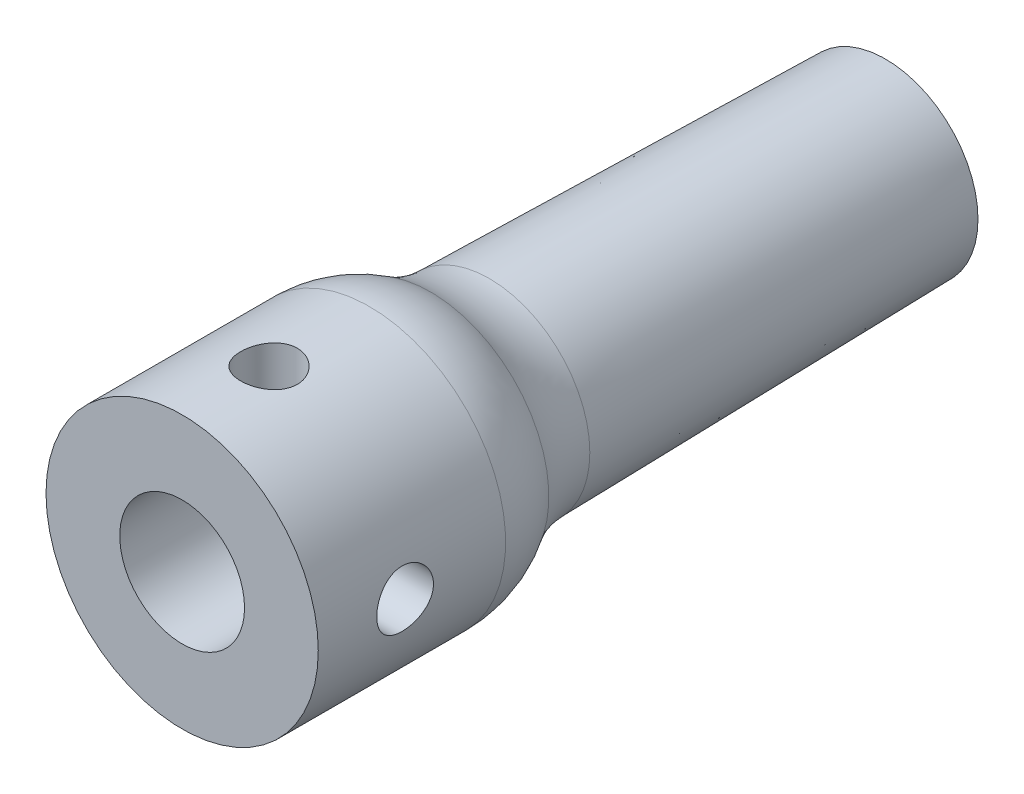
ISO-10303-21;
HEADER;
FILE_DESCRIPTION(('STEP AP214'),'2;1');
FILE_NAME('part.step','',(''),(''),'','','');
FILE_SCHEMA(('AUTOMOTIVE_DESIGN { 1 0 10303 214 1 1 1 1 }'));
ENDSEC;
DATA;
#1=APPLICATION_CONTEXT('core data for automotive mechanical design processes');
#2=APPLICATION_PROTOCOL_DEFINITION('international standard','automotive_design',2000,#1);
#3=PRODUCT_CONTEXT('',#1,'mechanical');
#4=PRODUCT('Part','Part','',(#3));
#5=PRODUCT_RELATED_PRODUCT_CATEGORY('part','',(#4));
#6=PRODUCT_DEFINITION_FORMATION('','',#4);
#7=PRODUCT_DEFINITION_CONTEXT('part definition',#1,'design');
#8=PRODUCT_DEFINITION('design','',#6,#7);
#9=PRODUCT_DEFINITION_SHAPE('','',#8);
#10=(LENGTH_UNIT() NAMED_UNIT(*) SI_UNIT(.MILLI.,.METRE.));
#11=(NAMED_UNIT(*) PLANE_ANGLE_UNIT() SI_UNIT($,.RADIAN.));
#12=(NAMED_UNIT(*) SI_UNIT($,.STERADIAN.) SOLID_ANGLE_UNIT());
#13=UNCERTAINTY_MEASURE_WITH_UNIT(LENGTH_MEASURE(1.E-05),#10,'distance_accuracy_value','');
#14=(GEOMETRIC_REPRESENTATION_CONTEXT(3) GLOBAL_UNCERTAINTY_ASSIGNED_CONTEXT((#13)) GLOBAL_UNIT_ASSIGNED_CONTEXT((#10,
#11,#12)) REPRESENTATION_CONTEXT('',''));
#15=CARTESIAN_POINT('',(0.,0.,0.));
#16=DIRECTION('',(0.,0.,1.));
#17=DIRECTION('',(1.,0.,0.));
#18=AXIS2_PLACEMENT_3D('',#15,#16,#17);
#19=CARTESIAN_POINT('',(0.,0.,0.));
#20=DIRECTION('',(0.,0.,1.));
#21=DIRECTION('',(1.,0.,0.));
#22=AXIS2_PLACEMENT_3D('',#19,#20,#21);
#23=PLANE('',#22);
#24=CARTESIAN_POINT('',(0.,0.,0.));
#25=DIRECTION('',(0.,0.,1.));
#26=DIRECTION('',(1.,0.,0.));
#27=AXIS2_PLACEMENT_3D('',#24,#25,#26);
#28=CIRCLE('',#27,4.07477969432257);
#29=CARTESIAN_POINT('',(4.07477969432257,0.,0.));
#30=VERTEX_POINT('',#29);
#31=EDGE_CURVE('E47',#30,#30,#28,.T.);
#32=ORIENTED_EDGE('',*,*,#31,.F.);
#33=EDGE_LOOP('',(#32));
#34=FACE_BOUND('',#33,.T.);
#35=CARTESIAN_POINT('',(0.,0.,0.));
#36=DIRECTION('',(0.,0.,1.));
#37=DIRECTION('',(1.,0.,0.));
#38=AXIS2_PLACEMENT_3D('',#35,#36,#37);
#39=CIRCLE('',#38,2.75);
#40=CARTESIAN_POINT('',(2.75,0.,0.));
#41=VERTEX_POINT('',#40);
#42=EDGE_CURVE('E52',#41,#41,#39,.T.);
#43=ORIENTED_EDGE('',*,*,#42,.T.);
#44=EDGE_LOOP('',(#43));
#45=FACE_BOUND('',#44,.T.);
#46=ADVANCED_FACE('F32',(#34,#45),#23,.F.);
#47=CARTESIAN_POINT('',(0.,0.,21.));
#48=DIRECTION('',(0.,0.,1.));
#49=DIRECTION('',(1.,0.,0.));
#50=AXIS2_PLACEMENT_3D('',#47,#48,#49);
#51=CONICAL_SURFACE('',#50,4.5,0.0202458193231343);
#52=CARTESIAN_POINT('',(0.,0.,17.4606792831943));
#53=DIRECTION('',(0.,0.,-1.));
#54=DIRECTION('',(-1.,0.,0.));
#55=AXIS2_PLACEMENT_3D('',#52,#53,#54);
#56=CIRCLE('',#55,4.42833376013854);
#57=CARTESIAN_POINT('',(-4.42833376013854,0.,17.4606792831943));
#58=VERTEX_POINT('',#57);
#59=EDGE_CURVE('E43',#58,#58,#56,.T.);
#60=ORIENTED_EDGE('',*,*,#59,.T.);
#61=EDGE_LOOP('',(#60));
#62=FACE_BOUND('',#61,.T.);
#63=ORIENTED_EDGE('',*,*,#31,.T.);
#64=EDGE_LOOP('',(#63));
#65=FACE_BOUND('',#64,.T.);
#66=ADVANCED_FACE('F112',(#62,#65),#51,.T.);
#67=CARTESIAN_POINT('',(0.,0.,21.));
#68=DIRECTION('',(0.,0.,-1.));
#69=DIRECTION('',(-1.,0.,0.));
#70=AXIS2_PLACEMENT_3D('',#67,#68,#69);
#71=CYLINDRICAL_SURFACE('',#70,2.75);
#72=CARTESIAN_POINT('',(-1.25000000000001,2.44948974278318,27.1729614874227));
#73=CARTESIAN_POINT('',(-1.24999649350402,2.44949368228765,27.2389699161995));
#74=CARTESIAN_POINT('',(-1.2447378244484,2.45219701957714,27.3050813094361));
#75=CARTESIAN_POINT('',(-1.22393957837269,2.46264090706274,27.4353438383866));
#76=CARTESIAN_POINT('',(-1.20837468013773,2.47039386281898,27.4994897379659));
#77=CARTESIAN_POINT('',(-1.16772642001969,2.48986254372279,27.6237000216856));
#78=CARTESIAN_POINT('',(-1.14268689094074,2.50155999360655,27.6837817216932));
#79=CARTESIAN_POINT('',(-1.08393224916964,2.52757186133796,27.7988765803601));
#80=CARTESIAN_POINT('',(-1.05021805532981,2.54188600196967,27.8538902750035));
#81=CARTESIAN_POINT('',(-0.972392408700577,2.57270625364897,27.9614086240548));
#82=CARTESIAN_POINT('',(-0.927732432282878,2.58929511801968,28.0134927196714));
#83=CARTESIAN_POINT('',(-0.83043006696107,2.62212163999063,28.1097497616301));
#84=CARTESIAN_POINT('',(-0.777784257759762,2.63835914368329,28.1539193004361));
#85=CARTESIAN_POINT('',(-0.662562027156228,2.66969243866209,28.2353870538531));
#86=CARTESIAN_POINT('',(-0.59960560002215,2.68468107121253,28.272192834668));
#87=CARTESIAN_POINT('',(-0.467587746509015,2.71078910043921,28.3345039831394));
#88=CARTESIAN_POINT('',(-0.398529543785711,2.72191052506912,28.3600152755192));
#89=CARTESIAN_POINT('',(-0.260702263713035,2.73844039615752,28.3974286544761));
#90=CARTESIAN_POINT('',(-0.192168860207244,2.74415398467794,28.4100612360869));
#91=CARTESIAN_POINT('',(-0.0537337492110804,2.75034616684861,28.4237387277347));
#92=CARTESIAN_POINT('',(0.0161672725634519,2.75082731987365,28.4247893029563));
#93=CARTESIAN_POINT('',(0.149965080853614,2.74666518415707,28.4156124739761));
#94=CARTESIAN_POINT('',(0.213931079826308,2.74238926124843,28.4061936197753));
#95=CARTESIAN_POINT('',(0.339258309266332,2.72972015837754,28.3777575542483));
#96=CARTESIAN_POINT('',(0.400619346222459,2.72132667311912,28.3587396311972));
#97=CARTESIAN_POINT('',(0.520129625913238,2.70105493201454,28.311451471528));
#98=CARTESIAN_POINT('',(0.578216222535315,2.68912586975713,28.2830455922203));
#99=CARTESIAN_POINT('',(0.688949986561342,2.66291017293157,28.2179388205696));
#100=CARTESIAN_POINT('',(0.74159515134029,2.64862267537057,28.1812348900002));
#101=CARTESIAN_POINT('',(0.844521462681004,2.61770923899541,28.0971117317786));
#102=CARTESIAN_POINT('',(0.894259880394276,2.60098761803526,28.0490628402856));
#103=CARTESIAN_POINT('',(0.985234665281752,2.56790977516793,27.9453443644101));
#104=CARTESIAN_POINT('',(1.02646641790381,2.55155375585301,27.8896706709549));
#105=CARTESIAN_POINT('',(1.10104506894183,2.52029978809173,27.7691515377821));
#106=CARTESIAN_POINT('',(1.13395121798233,2.50550118974753,27.7040052374333));
#107=CARTESIAN_POINT('',(1.1880966741559,2.48028797326795,27.5682511572691));
#108=CARTESIAN_POINT('',(1.20934612514664,2.46986954528397,27.4976481871876));
#109=CARTESIAN_POINT('',(1.23805393738081,2.45559834607939,27.3584332769877));
#110=CARTESIAN_POINT('',(1.24640186410718,2.45132366398273,27.2900491765278));
#111=CARTESIAN_POINT('',(1.25172089001371,2.44861334601463,27.1527381902121));
#112=CARTESIAN_POINT('',(1.24869736351006,2.45017495182541,27.0838115761232));
#113=CARTESIAN_POINT('',(1.2321742269346,2.45851920297554,26.9533932204686));
#114=CARTESIAN_POINT('',(1.21955926621106,2.4648605869208,26.8917571596424));
#115=CARTESIAN_POINT('',(1.18544405201489,2.48144703005369,26.7715538899964));
#116=CARTESIAN_POINT('',(1.16394143575354,2.49169312725522,26.7129875019199));
#117=CARTESIAN_POINT('',(1.11159822979466,2.51549375704147,26.5975962512233));
#118=CARTESIAN_POINT('',(1.08037807246865,2.52917735570446,26.5409711150016));
#119=CARTESIAN_POINT('',(1.00984087724323,2.55815836558199,26.4334618868724));
#120=CARTESIAN_POINT('',(0.970519936824034,2.57345655287929,26.3825805803879));
#121=CARTESIAN_POINT('',(0.880267857698424,2.60579094908277,26.2826801814853));
#122=CARTESIAN_POINT('',(0.828567938261515,2.62284763397897,26.2343592537482));
#123=CARTESIAN_POINT('',(0.717441468187266,2.6553959105149,26.1469123741477));
#124=CARTESIAN_POINT('',(0.658013600012903,2.67088723447429,26.1077879934032));
#125=CARTESIAN_POINT('',(0.532064634336902,2.69881612600613,26.0395640040982));
#126=CARTESIAN_POINT('',(0.465471699055584,2.71121763780736,26.0105812937458));
#127=CARTESIAN_POINT('',(0.327635980482038,2.73129834562413,25.964481031089));
#128=CARTESIAN_POINT('',(0.256396588146275,2.73898094374761,25.9473549296094));
#129=CARTESIAN_POINT('',(0.117466176582578,2.74830068808535,25.9266738973591));
#130=CARTESIAN_POINT('',(0.0499494636179257,2.75037367442807,25.9221397931885));
#131=CARTESIAN_POINT('',(-0.0848898576600219,2.74951533998594,25.9240273595185));
#132=CARTESIAN_POINT('',(-0.152212508787349,2.74658522376394,25.9304463929067));
#133=CARTESIAN_POINT('',(-0.281391999197506,2.73629690997646,25.9533642646965));
#134=CARTESIAN_POINT('',(-0.343356169931427,2.72915761294651,25.969365387763));
#135=CARTESIAN_POINT('',(-0.463664188063046,2.71131278427636,26.0103965311602));
#136=CARTESIAN_POINT('',(-0.522007419358078,2.70060664770133,26.0354280831084));
#137=CARTESIAN_POINT('',(-0.636378008545826,2.6760233581899,26.0950600288525));
#138=CARTESIAN_POINT('',(-0.692177439915833,2.66202358016364,26.130045670727));
#139=CARTESIAN_POINT('',(-0.797359045105219,2.63243399966462,26.2080722679654));
#140=CARTESIAN_POINT('',(-0.846738398309358,2.61684350365391,26.2511167437919));
#141=CARTESIAN_POINT('',(-0.941951228398719,2.5841761482303,26.3482042521535));
#142=CARTESIAN_POINT('',(-0.987154004244797,2.56708296999994,26.4028623846656));
#143=CARTESIAN_POINT('',(-1.06790018403239,2.53455914709152,26.51942008708));
#144=CARTESIAN_POINT('',(-1.10343722102546,2.51912960228939,26.5813243919205));
#145=CARTESIAN_POINT('',(-1.16392442382468,2.49176565985743,26.7114739449307));
#146=CARTESIAN_POINT('',(-1.18878813351712,2.47986003874525,26.7797657124466));
#147=CARTESIAN_POINT('',(-1.22631765086684,2.46152275925821,26.9201973216138));
#148=CARTESIAN_POINT('',(-1.23902440311468,2.45507273502283,26.9923233766772));
#149=CARTESIAN_POINT('',(-1.24688636059437,2.45107611117236,27.08295258552));
#150=CARTESIAN_POINT('',(-1.24805272823734,2.45048261290847,27.1009269311961));
#151=CARTESIAN_POINT('',(-1.24961004053751,2.44968888381115,27.1369187867105));
#152=CARTESIAN_POINT('',(-1.25000095753309,2.44948866700671,27.1549362980656));
#153=CARTESIAN_POINT('',(-1.25000000000001,2.44948974278318,27.1729614874227));
#154=B_SPLINE_CURVE_WITH_KNOTS('',3,(#72,#73,#74,#75,#76,#77,#78,#79,#80,#81,#82,#83,#84,#85,
#86,#87,#88,#89,#90,#91,#92,#93,#94,#95,#96,#97,#98,#99,#100,#101,#102,#103,#104,#105,#106,#107,
#108,#109,#110,#111,#112,#113,#114,#115,#116,#117,#118,#119,#120,#121,#122,#123,#124,#125,#126,
#127,#128,#129,#130,#131,#132,#133,#134,#135,#136,#137,#138,#139,#140,#141,#142,#143,#144,#145,
#146,#147,#148,#149,#150,#151,#152,#153),.UNSPECIFIED.,.T.,.F.,(4,2,2,2,2,2,2,2,2,2,2,2,2,2,2,2,
2,2,2,2,2,2,2,2,2,2,2,2,2,2,2,2,2,2,2,2,2,2,2,2,4),(0.,0.197949490145129,0.396387132894558,
0.593917744022097,0.791427440589959,1.00227982105295,1.21322276498815,1.43542192427071,
1.65750438655095,1.86613997239169,2.07467350237463,2.26815547775457,2.46165180100119,
2.65807591784026,2.85457206969011,3.06708946120133,3.27972183419203,3.50196731162577,
3.72401907920019,3.92994297853523,4.13576956743683,4.32461933407749,4.51351933887032,
4.71099397075556,4.90856395864764,5.12594226056978,5.34335767200034,5.5632024114476,
5.78288846688929,5.98493699995733,6.18693689403808,6.37925788088371,6.57161150192545,
6.77276176443707,6.97400010437292,7.19187634216838,7.40989575221213,7.62964928571055,
7.8486600571131,7.90271299908979,7.95676786918959),.UNSPECIFIED.);
#155=CARTESIAN_POINT('',(-1.25000000000001,2.44948974278318,27.1729614874227));
#156=VERTEX_POINT('',#155);
#157=EDGE_CURVE('E69',#156,#156,#154,.T.);
#158=ORIENTED_EDGE('',*,*,#157,.T.);
#159=EDGE_LOOP('',(#158));
#160=FACE_BOUND('',#159,.T.);
#161=CARTESIAN_POINT('',(2.44948974278318,1.25,27.1729614874227));
#162=CARTESIAN_POINT('',(2.44949368228765,1.24999649350401,27.2389699161995));
#163=CARTESIAN_POINT('',(2.45219701957715,1.24473782444839,27.3050813094361));
#164=CARTESIAN_POINT('',(2.46264090706275,1.22393957837268,27.4353438383866));
#165=CARTESIAN_POINT('',(2.47039386281899,1.20837468013772,27.4994897379659));
#166=CARTESIAN_POINT('',(2.4898625437228,1.16772642001968,27.6237000216856));
#167=CARTESIAN_POINT('',(2.50155999360655,1.14268689094073,27.6837817216932));
#168=CARTESIAN_POINT('',(2.52757186133796,1.08393224916963,27.7988765803601));
#169=CARTESIAN_POINT('',(2.54188600196967,1.0502180553298,27.8538902750035));
#170=CARTESIAN_POINT('',(2.57270625364897,0.972392408700568,27.9614086240548));
#171=CARTESIAN_POINT('',(2.58929511801969,0.92773243228287,28.0134927196714));
#172=CARTESIAN_POINT('',(2.62212163999064,0.830430066961062,28.1097497616301));
#173=CARTESIAN_POINT('',(2.6383591436833,0.777784257759754,28.1539193004361));
#174=CARTESIAN_POINT('',(2.6696924386621,0.662562027156218,28.2353870538531));
#175=CARTESIAN_POINT('',(2.68468107121254,0.599605600022141,28.272192834668));
#176=CARTESIAN_POINT('',(2.71078910043921,0.467587746509006,28.3345039831394));
#177=CARTESIAN_POINT('',(2.72191052506912,0.398529543785702,28.3600152755192));
#178=CARTESIAN_POINT('',(2.73844039615752,0.260702263713026,28.3974286544761));
#179=CARTESIAN_POINT('',(2.74415398467794,0.192168860207235,28.4100612360869));
#180=CARTESIAN_POINT('',(2.75034616684861,0.0537337492110712,28.4237387277347));
#181=CARTESIAN_POINT('',(2.75082731987365,-0.016167272563461,28.4247893029563));
#182=CARTESIAN_POINT('',(2.74666518415707,-0.149965080853623,28.4156124739761));
#183=CARTESIAN_POINT('',(2.74238926124843,-0.213931079826317,28.4061936197753));
#184=CARTESIAN_POINT('',(2.72972015837753,-0.339258309266341,28.3777575542483));
#185=CARTESIAN_POINT('',(2.72132667311912,-0.400619346222469,28.3587396311972));
#186=CARTESIAN_POINT('',(2.70105493201454,-0.520129625913247,28.311451471528));
#187=CARTESIAN_POINT('',(2.68912586975713,-0.578216222535324,28.2830455922203));
#188=CARTESIAN_POINT('',(2.66291017293157,-0.688949986561352,28.2179388205696));
#189=CARTESIAN_POINT('',(2.64862267537057,-0.741595151340299,28.1812348900002));
#190=CARTESIAN_POINT('',(2.61770923899541,-0.844521462681013,28.0971117317786));
#191=CARTESIAN_POINT('',(2.60098761803526,-0.894259880394285,28.0490628402856));
#192=CARTESIAN_POINT('',(2.56790977516793,-0.985234665281761,27.9453443644101));
#193=CARTESIAN_POINT('',(2.551553755853,-1.02646641790382,27.8896706709549));
#194=CARTESIAN_POINT('',(2.52029978809173,-1.10104506894183,27.7691515377821));
#195=CARTESIAN_POINT('',(2.50550118974752,-1.13395121798234,27.7040052374333));
#196=CARTESIAN_POINT('',(2.48028797326795,-1.18809667415591,27.5682511572691));
#197=CARTESIAN_POINT('',(2.46986954528397,-1.20934612514665,27.4976481871876));
#198=CARTESIAN_POINT('',(2.45559834607939,-1.23805393738082,27.3584332769877));
#199=CARTESIAN_POINT('',(2.45132366398273,-1.24640186410719,27.2900491765278));
#200=CARTESIAN_POINT('',(2.44861334601462,-1.25172089001372,27.1527381902121));
#201=CARTESIAN_POINT('',(2.45017495182541,-1.24869736351006,27.0838115761232));
#202=CARTESIAN_POINT('',(2.45851920297554,-1.23217422693461,26.9533932204686));
#203=CARTESIAN_POINT('',(2.46486058692079,-1.21955926621107,26.8917571596424));
#204=CARTESIAN_POINT('',(2.48144703005369,-1.18544405201489,26.7715538899964));
#205=CARTESIAN_POINT('',(2.49169312725522,-1.16394143575355,26.7129875019199));
#206=CARTESIAN_POINT('',(2.51549375704146,-1.11159822979467,26.5975962512233));
#207=CARTESIAN_POINT('',(2.52917735570445,-1.08037807246866,26.5409711150016));
#208=CARTESIAN_POINT('',(2.55815836558199,-1.00984087724324,26.4334618868724));
#209=CARTESIAN_POINT('',(2.57345655287928,-0.970519936824045,26.3825805803879));
#210=CARTESIAN_POINT('',(2.60579094908277,-0.880267857698436,26.2826801814853));
#211=CARTESIAN_POINT('',(2.62284763397897,-0.828567938261526,26.2343592537482));
#212=CARTESIAN_POINT('',(2.65539591051489,-0.717441468187277,26.1469123741477));
#213=CARTESIAN_POINT('',(2.67088723447429,-0.658013600012915,26.1077879934032));
#214=CARTESIAN_POINT('',(2.69881612600612,-0.532064634336915,26.0395640040982));
#215=CARTESIAN_POINT('',(2.71121763780736,-0.465471699055596,26.0105812937458));
#216=CARTESIAN_POINT('',(2.73129834562413,-0.32763598048205,25.964481031089));
#217=CARTESIAN_POINT('',(2.73898094374761,-0.256396588146287,25.9473549296094));
#218=CARTESIAN_POINT('',(2.74830068808534,-0.117466176582589,25.9266738973591));
#219=CARTESIAN_POINT('',(2.75037367442807,-0.0499494636179371,25.9221397931885));
#220=CARTESIAN_POINT('',(2.74951533998594,0.0848898576600104,25.9240273595185));
#221=CARTESIAN_POINT('',(2.74658522376394,0.152212508787337,25.9304463929067));
#222=CARTESIAN_POINT('',(2.73629690997646,0.281391999197495,25.9533642646965));
#223=CARTESIAN_POINT('',(2.72915761294651,0.343356169931416,25.969365387763));
#224=CARTESIAN_POINT('',(2.71131278427636,0.463664188063035,26.0103965311602));
#225=CARTESIAN_POINT('',(2.70060664770133,0.522007419358068,26.0354280831084));
#226=CARTESIAN_POINT('',(2.6760233581899,0.636378008545817,26.0950600288525));
#227=CARTESIAN_POINT('',(2.66202358016364,0.692177439915824,26.130045670727));
#228=CARTESIAN_POINT('',(2.63243399966462,0.797359045105211,26.2080722679654));
#229=CARTESIAN_POINT('',(2.61684350365391,0.846738398309348,26.2511167437919));
#230=CARTESIAN_POINT('',(2.5841761482303,0.94195122839871,26.3482042521535));
#231=CARTESIAN_POINT('',(2.56708296999995,0.987154004244788,26.4028623846656));
#232=CARTESIAN_POINT('',(2.53455914709152,1.06790018403238,26.51942008708));
#233=CARTESIAN_POINT('',(2.51912960228939,1.10343722102546,26.5813243919205));
#234=CARTESIAN_POINT('',(2.49176565985743,1.16392442382467,26.7114739449307));
#235=CARTESIAN_POINT('',(2.47986003874526,1.18878813351711,26.7797657124466));
#236=CARTESIAN_POINT('',(2.46152275925821,1.22631765086683,26.9201973216138));
#237=CARTESIAN_POINT('',(2.45507273502283,1.23902440311468,26.9923233766772));
#238=CARTESIAN_POINT('',(2.45107611117236,1.24688636059436,27.08295258552));
#239=CARTESIAN_POINT('',(2.45048261290848,1.24805272823733,27.1009269311961));
#240=CARTESIAN_POINT('',(2.44968888381116,1.2496100405375,27.1369187867105));
#241=CARTESIAN_POINT('',(2.44948866700672,1.25000095753308,27.1549362980656));
#242=CARTESIAN_POINT('',(2.44948974278318,1.25,27.1729614874227));
#243=B_SPLINE_CURVE_WITH_KNOTS('',3,(#161,#162,#163,#164,#165,#166,#167,#168,#169,#170,#171,
#172,#173,#174,#175,#176,#177,#178,#179,#180,#181,#182,#183,#184,#185,#186,#187,#188,#189,#190,
#191,#192,#193,#194,#195,#196,#197,#198,#199,#200,#201,#202,#203,#204,#205,#206,#207,#208,#209,
#210,#211,#212,#213,#214,#215,#216,#217,#218,#219,#220,#221,#222,#223,#224,#225,#226,#227,#228,
#229,#230,#231,#232,#233,#234,#235,#236,#237,#238,#239,#240,#241,#242),.UNSPECIFIED.,.T.,.F.,(4,
2,2,2,2,2,2,2,2,2,2,2,2,2,2,2,2,2,2,2,2,2,2,2,2,2,2,2,2,2,2,2,2,2,2,2,2,2,2,2,4),(0.,
0.197949490145129,0.396387132894558,0.593917744022089,0.791427440589959,1.00227982105295,
1.21322276498815,1.43542192427071,1.65750438655095,1.86613997239169,2.07467350237463,
2.26815547775457,2.46165180100119,2.65807591784026,2.85457206969012,3.06708946120133,
3.27972183419203,3.50196731162577,3.72401907920019,3.92994297853523,4.13576956743683,
4.32461933407749,4.51351933887032,4.71099397075556,4.90856395864764,5.12594226056978,
5.34335767200034,5.5632024114476,5.78288846688929,5.98493699995733,6.18693689403808,
6.37925788088371,6.57161150192545,6.77276176443707,6.97400010437292,7.19187634216838,
7.40989575221213,7.62964928571055,7.8486600571131,7.90271299908979,7.9567678691896),.UNSPECIFIED.);
#244=CARTESIAN_POINT('',(2.44948974278318,1.25,27.1729614874227));
#245=VERTEX_POINT('',#244);
#246=EDGE_CURVE('E61',#245,#245,#243,.T.);
#247=ORIENTED_EDGE('',*,*,#246,.T.);
#248=EDGE_LOOP('',(#247));
#249=FACE_BOUND('',#248,.T.);
#250=ORIENTED_EDGE('',*,*,#42,.F.);
#251=EDGE_LOOP('',(#250));
#252=FACE_BOUND('',#251,.T.);
#253=CARTESIAN_POINT('',(0.,0.,31.));
#254=DIRECTION('',(0.,0.,1.));
#255=DIRECTION('',(1.,0.,0.));
#256=AXIS2_PLACEMENT_3D('',#253,#254,#255);
#257=CIRCLE('',#256,2.75);
#258=CARTESIAN_POINT('',(2.75,0.,31.));
#259=VERTEX_POINT('',#258);
#260=EDGE_CURVE('E58',#259,#259,#257,.T.);
#261=ORIENTED_EDGE('',*,*,#260,.T.);
#262=EDGE_LOOP('',(#261));
#263=FACE_BOUND('',#262,.T.);
#264=ADVANCED_FACE('F107',(#160,#249,#252,#263),#71,.F.);
#265=CARTESIAN_POINT('',(0.,0.,31.));
#266=DIRECTION('',(0.,0.,1.));
#267=DIRECTION('',(1.,0.,0.));
#268=AXIS2_PLACEMENT_3D('',#265,#266,#267);
#269=PLANE('',#268);
#270=CARTESIAN_POINT('',(0.,0.,31.));
#271=DIRECTION('',(0.,0.,1.));
#272=DIRECTION('',(1.,0.,0.));
#273=AXIS2_PLACEMENT_3D('',#270,#271,#272);
#274=CIRCLE('',#273,6.);
#275=CARTESIAN_POINT('',(6.,0.,31.));
#276=VERTEX_POINT('',#275);
#277=EDGE_CURVE('E55',#276,#276,#274,.T.);
#278=ORIENTED_EDGE('',*,*,#277,.T.);
#279=EDGE_LOOP('',(#278));
#280=FACE_BOUND('',#279,.T.);
#281=ORIENTED_EDGE('',*,*,#260,.F.);
#282=EDGE_LOOP('',(#281));
#283=FACE_BOUND('',#282,.T.);
#284=ADVANCED_FACE('F99',(#280,#283),#269,.T.);
#285=CARTESIAN_POINT('',(0.,0.,31.));
#286=DIRECTION('',(0.,0.,-1.));
#287=DIRECTION('',(-1.,0.,0.));
#288=AXIS2_PLACEMENT_3D('',#285,#286,#287);
#289=CYLINDRICAL_SURFACE('',#288,6.);
#290=CARTESIAN_POINT('',(-1.25000000000002,5.86834729715275,27.1729614874227));
#291=CARTESIAN_POINT('',(-1.24999750877602,5.86834869213645,27.2423521025738));
#292=CARTESIAN_POINT('',(-1.2442022943395,5.86959145924543,27.3117734594379));
#293=CARTESIAN_POINT('',(-1.22119649233781,5.87442015581797,27.44864780474));
#294=CARTESIAN_POINT('',(-1.20397715440344,5.87800788138388,27.5160992429291));
#295=CARTESIAN_POINT('',(-1.15868397507233,5.8871029296193,27.6470338602576));
#296=CARTESIAN_POINT('',(-1.13062141248935,5.89260825706945,27.7105210834145));
#297=CARTESIAN_POINT('',(-1.06446988601735,5.90491581335741,27.8318859870683));
#298=CARTESIAN_POINT('',(-1.02638132735822,5.91171798977622,27.8897638941527));
#299=CARTESIAN_POINT('',(-0.940636399466105,5.92596934661467,27.9991568625762));
#300=CARTESIAN_POINT('',(-0.892855554869692,5.93342614373039,28.0505733810492));
#301=CARTESIAN_POINT('',(-0.78935122388066,5.94807966802575,28.1447225560708));
#302=CARTESIAN_POINT('',(-0.733627155456027,5.95527637609914,28.1874545757142));
#303=CARTESIAN_POINT('',(-0.615162052999614,5.96868135118848,28.2634073755056));
#304=CARTESIAN_POINT('',(-0.552359428204966,5.97487958631242,28.296534013886));
#305=CARTESIAN_POINT('',(-0.421928551006743,5.98550347343302,28.3517275402825));
#306=CARTESIAN_POINT('',(-0.354300789950614,5.98992930561222,28.3737955525763));
#307=CARTESIAN_POINT('',(-0.217162904200525,5.99645589892179,28.4059372485402));
#308=CARTESIAN_POINT('',(-0.14769338091638,5.99858891959926,28.4161775046179));
#309=CARTESIAN_POINT('',(-0.0079918488395471,6.00040112580612,28.4248931831797));
#310=CARTESIAN_POINT('',(0.0622400797368158,6.0000805670369,28.4233698316158));
#311=CARTESIAN_POINT('',(0.20032658619955,5.99704658090511,28.408726886466));
#312=CARTESIAN_POINT('',(0.268201128726453,5.99437018956585,28.3957867684646));
#313=CARTESIAN_POINT('',(0.400793746289731,5.98696720898885,28.3589628620914));
#314=CARTESIAN_POINT('',(0.465511687511,5.98224053291904,28.3350786102197));
#315=CARTESIAN_POINT('',(0.590460005384662,5.97120767323924,28.2768814352972));
#316=CARTESIAN_POINT('',(0.650657134981629,5.96489104125346,28.2424991932131));
#317=CARTESIAN_POINT('',(0.764493456510627,5.95137300440189,28.1643334845823));
#318=CARTESIAN_POINT('',(0.818131831816397,5.94417148958325,28.1205488492166));
#319=CARTESIAN_POINT('',(0.918394203276892,5.92951700233276,28.0238398625317));
#320=CARTESIAN_POINT('',(0.964866487494775,5.92206184975926,27.9707584274408));
#321=CARTESIAN_POINT('',(1.04827597240486,5.90786872648996,27.8574794384279));
#322=CARTESIAN_POINT('',(1.08521296069978,5.90113077177161,27.7972817260355));
#323=CARTESIAN_POINT('',(1.14856217138452,5.88912998409156,27.6712492325939));
#324=CARTESIAN_POINT('',(1.17494805489725,5.88387085232125,27.6054008367293));
#325=CARTESIAN_POINT('',(1.21623577538671,5.87547606410361,27.4700698680533));
#326=CARTESIAN_POINT('',(1.23113924882347,5.87234010507183,27.4005878146146));
#327=CARTESIAN_POINT('',(1.24880863867015,5.86860783239132,27.2613417811038));
#328=CARTESIAN_POINT('',(1.25179442917996,5.86796551863475,27.1916069028857));
#329=CARTESIAN_POINT('',(1.24613693439292,5.86916952018704,27.0526356758826));
#330=CARTESIAN_POINT('',(1.23749436857861,5.87101568152624,26.9833992965204));
#331=CARTESIAN_POINT('',(1.20901558325482,5.87694538226167,26.8481409713646));
#332=CARTESIAN_POINT('',(1.18929841376869,5.88100511282998,26.7820928202439));
#333=CARTESIAN_POINT('',(1.13935810860917,5.8908833850312,26.6542374979811));
#334=CARTESIAN_POINT('',(1.10913404556144,5.89670208191058,26.5924307017723));
#335=CARTESIAN_POINT('',(1.03854598181483,5.90954501937192,26.4738550462065));
#336=CARTESIAN_POINT('',(0.998045327353943,5.91658506648324,26.4171692829566));
#337=CARTESIAN_POINT('',(0.90823444056986,5.93103483993908,26.3113182382677));
#338=CARTESIAN_POINT('',(0.858923220505153,5.93844460766532,26.2621538011835));
#339=CARTESIAN_POINT('',(0.751900450843319,5.95294924316737,26.1718987743256));
#340=CARTESIAN_POINT('',(0.694061907614531,5.9600367471991,26.1309573923963));
#341=CARTESIAN_POINT('',(0.572200102216338,5.97296708772407,26.0593727353347));
#342=CARTESIAN_POINT('',(0.50817711347686,5.97880997920818,26.0287290051853));
#343=CARTESIAN_POINT('',(0.376142117847898,5.98856148270679,25.9788228081054));
#344=CARTESIAN_POINT('',(0.308156710970174,5.99248163136497,25.9594923218784));
#345=CARTESIAN_POINT('',(0.169813400503452,5.99799561410226,25.9325470834146));
#346=CARTESIAN_POINT('',(0.0994558094616747,5.99958975342889,25.92493079389));
#347=CARTESIAN_POINT('',(-0.0402133434703598,6.00026408056941,25.9216938653742));
#348=CARTESIAN_POINT('',(-0.109519592177943,5.99939113754811,25.925849587428));
#349=CARTESIAN_POINT('',(-0.246422870373574,5.99532874094472,25.9455421260757));
#350=CARTESIAN_POINT('',(-0.314019925202724,5.99213932172839,25.9610787738295));
#351=CARTESIAN_POINT('',(-0.445431965492074,5.98380460077544,26.0029892820713));
#352=CARTESIAN_POINT('',(-0.509256550004545,5.97866453407556,26.0293341512758));
#353=CARTESIAN_POINT('',(-0.631610567220763,5.96697995347704,26.0920838851547));
#354=CARTESIAN_POINT('',(-0.690139538279532,5.96043531730246,26.1284896257659));
#355=CARTESIAN_POINT('',(-0.801340321298283,5.94651596786386,26.211071155416));
#356=CARTESIAN_POINT('',(-0.85389263361595,5.93912880302851,26.2574057754794));
#357=CARTESIAN_POINT('',(-0.950552741980409,5.92442786811349,26.3582059884198));
#358=CARTESIAN_POINT('',(-0.994658521571255,5.91711411595368,26.4126735173712));
#359=CARTESIAN_POINT('',(-1.07367451852769,5.90329191643327,26.5289705898562));
#360=CARTESIAN_POINT('',(-1.10846928126996,5.89679406702551,26.5908798988848));
#361=CARTESIAN_POINT('',(-1.16710627925308,5.88547039658062,26.719786643506));
#362=CARTESIAN_POINT('',(-1.19095816292462,5.880643103526,26.7867795358757));
#363=CARTESIAN_POINT('',(-1.22256554131863,5.87414004405195,26.9070677689912));
#364=CARTESIAN_POINT('',(-1.23283449005673,5.87198163591588,26.9596910240158));
#365=CARTESIAN_POINT('',(-1.24655254358406,5.86908475266777,27.0658572679437));
#366=CARTESIAN_POINT('',(-1.25000192292743,5.86834622039193,27.1194002197328));
#367=CARTESIAN_POINT('',(-1.25000000000002,5.86834729715275,27.1729614874227));
#368=B_SPLINE_CURVE_WITH_KNOTS('',3,(#290,#291,#292,#293,#294,#295,#296,#297,#298,#299,#300,
#301,#302,#303,#304,#305,#306,#307,#308,#309,#310,#311,#312,#313,#314,#315,#316,#317,#318,#319,
#320,#321,#322,#323,#324,#325,#326,#327,#328,#329,#330,#331,#332,#333,#334,#335,#336,#337,#338,
#339,#340,#341,#342,#343,#344,#345,#346,#347,#348,#349,#350,#351,#352,#353,#354,#355,#356,#357,
#358,#359,#360,#361,#362,#363,#364,#365,#366,#367),.UNSPECIFIED.,.T.,.F.,(4,2,2,2,2,2,2,2,2,2,2,
2,2,2,2,2,2,2,2,2,2,2,2,2,2,2,2,2,2,2,2,2,2,2,2,2,2,2,4),(0.,0.207975654071266,0.41611079241747,
0.624030014802723,0.831940834815793,1.04271333467885,1.25350128663873,1.46629026266844,
1.67905760106933,1.88879048859265,2.09850151896339,2.30497341416461,2.51145405455871,
2.7193287197795,2.9272292410426,3.13905862244914,3.35089272191628,3.56325237332488,
3.77558175387598,3.98397516009793,4.19235567296524,4.39853786231923,4.60473825464031,
4.81383917934652,5.02296356082186,5.23559458753345,5.44821621759041,5.65954599648535,
5.87084803959582,6.07816293922646,6.28547476332982,6.49223410585101,6.69901145528175,
6.90938318978575,7.11980508427536,7.33272651358124,7.54545984571989,7.70599867585771,
7.86653104261162),.UNSPECIFIED.);
#369=CARTESIAN_POINT('',(-1.25000000000002,5.86834729715275,27.1729614874227));
#370=VERTEX_POINT('',#369);
#371=EDGE_CURVE('E87',#370,#370,#368,.T.);
#372=ORIENTED_EDGE('',*,*,#371,.F.);
#373=EDGE_LOOP('',(#372));
#374=FACE_BOUND('',#373,.T.);
#375=CARTESIAN_POINT('',(5.86834729715275,1.25,27.1729614874227));
#376=CARTESIAN_POINT('',(5.86834869213645,1.249997508776,27.2423521025738));
#377=CARTESIAN_POINT('',(5.86959145924544,1.24420229433948,27.3117734594379));
#378=CARTESIAN_POINT('',(5.87442015581798,1.22119649233779,27.44864780474));
#379=CARTESIAN_POINT('',(5.87800788138388,1.20397715440342,27.5160992429291));
#380=CARTESIAN_POINT('',(5.8871029296193,1.15868397507231,27.6470338602576));
#381=CARTESIAN_POINT('',(5.89260825706945,1.13062141248933,27.7105210834145));
#382=CARTESIAN_POINT('',(5.90491581335741,1.06446988601733,27.8318859870683));
#383=CARTESIAN_POINT('',(5.91171798977622,1.0263813273582,27.8897638941527));
#384=CARTESIAN_POINT('',(5.92596934661468,0.940636399466085,27.9991568625762));
#385=CARTESIAN_POINT('',(5.93342614373039,0.892855554869671,28.0505733810492));
#386=CARTESIAN_POINT('',(5.94807966802575,0.78935122388064,28.1447225560708));
#387=CARTESIAN_POINT('',(5.95527637609915,0.733627155456006,28.1874545757142));
#388=CARTESIAN_POINT('',(5.96868135118848,0.615162052999593,28.2634073755056));
#389=CARTESIAN_POINT('',(5.97487958631243,0.552359428204945,28.296534013886));
#390=CARTESIAN_POINT('',(5.98550347343303,0.421928551006723,28.3517275402825));
#391=CARTESIAN_POINT('',(5.98992930561223,0.354300789950594,28.3737955525763));
#392=CARTESIAN_POINT('',(5.99645589892179,0.217162904200504,28.4059372485402));
#393=CARTESIAN_POINT('',(5.99858891959926,0.14769338091636,28.4161775046179));
#394=CARTESIAN_POINT('',(6.00040112580612,0.00799184883952644,28.4248931831797));
#395=CARTESIAN_POINT('',(6.0000805670369,-0.0622400797368365,28.4233698316158));
#396=CARTESIAN_POINT('',(5.99704658090511,-0.20032658619957,28.408726886466));
#397=CARTESIAN_POINT('',(5.99437018956584,-0.268201128726475,28.3957867684646));
#398=CARTESIAN_POINT('',(5.98696720898885,-0.400793746289752,28.3589628620914));
#399=CARTESIAN_POINT('',(5.98224053291904,-0.465511687511021,28.3350786102197));
#400=CARTESIAN_POINT('',(5.97120767323924,-0.590460005384683,28.2768814352972));
#401=CARTESIAN_POINT('',(5.96489104125346,-0.650657134981649,28.2424991932131));
#402=CARTESIAN_POINT('',(5.95137300440189,-0.764493456510647,28.1643334845823));
#403=CARTESIAN_POINT('',(5.94417148958325,-0.818131831816418,28.1205488492166));
#404=CARTESIAN_POINT('',(5.92951700233276,-0.918394203276912,28.0238398625317));
#405=CARTESIAN_POINT('',(5.92206184975926,-0.964866487494794,27.9707584274408));
#406=CARTESIAN_POINT('',(5.90786872648996,-1.04827597240488,27.8574794384279));
#407=CARTESIAN_POINT('',(5.9011307717716,-1.0852129606998,27.7972817260355));
#408=CARTESIAN_POINT('',(5.88912998409156,-1.14856217138454,27.6712492325939));
#409=CARTESIAN_POINT('',(5.88387085232125,-1.17494805489727,27.6054008367293));
#410=CARTESIAN_POINT('',(5.8754760641036,-1.21623577538673,27.4700698680533));
#411=CARTESIAN_POINT('',(5.87234010507182,-1.23113924882349,27.4005878146146));
#412=CARTESIAN_POINT('',(5.86860783239132,-1.24880863867017,27.2613417811038));
#413=CARTESIAN_POINT('',(5.86796551863474,-1.25179442917998,27.1916069028857));
#414=CARTESIAN_POINT('',(5.86916952018704,-1.24613693439294,27.0526356758826));
#415=CARTESIAN_POINT('',(5.87101568152623,-1.23749436857863,26.9833992965204));
#416=CARTESIAN_POINT('',(5.87694538226166,-1.20901558325484,26.8481409713646));
#417=CARTESIAN_POINT('',(5.88100511282997,-1.18929841376871,26.7820928202439));
#418=CARTESIAN_POINT('',(5.8908833850312,-1.13935810860919,26.6542374979811));
#419=CARTESIAN_POINT('',(5.89670208191057,-1.10913404556147,26.5924307017723));
#420=CARTESIAN_POINT('',(5.90954501937191,-1.03854598181485,26.4738550462065));
#421=CARTESIAN_POINT('',(5.91658506648323,-0.998045327353964,26.4171692829566));
#422=CARTESIAN_POINT('',(5.93103483993908,-0.90823444056988,26.3113182382677));
#423=CARTESIAN_POINT('',(5.93844460766532,-0.858923220505174,26.2621538011835));
#424=CARTESIAN_POINT('',(5.95294924316736,-0.75190045084334,26.1718987743256));
#425=CARTESIAN_POINT('',(5.9600367471991,-0.694061907614551,26.1309573923963));
#426=CARTESIAN_POINT('',(5.97296708772407,-0.572200102216359,26.0593727353347));
#427=CARTESIAN_POINT('',(5.97880997920818,-0.508177113476881,26.0287290051853));
#428=CARTESIAN_POINT('',(5.98856148270679,-0.376142117847919,25.9788228081054));
#429=CARTESIAN_POINT('',(5.99248163136497,-0.308156710970195,25.9594923218784));
#430=CARTESIAN_POINT('',(5.99799561410226,-0.169813400503473,25.9325470834146));
#431=CARTESIAN_POINT('',(5.99958975342889,-0.0994558094616965,25.92493079389));
#432=CARTESIAN_POINT('',(6.00026408056941,0.0402133434703377,25.9216938653742));
#433=CARTESIAN_POINT('',(5.99939113754811,0.109519592177921,25.925849587428));
#434=CARTESIAN_POINT('',(5.99532874094472,0.246422870373552,25.9455421260757));
#435=CARTESIAN_POINT('',(5.99213932172839,0.314019925202702,25.9610787738295));
#436=CARTESIAN_POINT('',(5.98380460077544,0.445431965492053,26.0029892820713));
#437=CARTESIAN_POINT('',(5.97866453407556,0.509256550004524,26.0293341512758));
#438=CARTESIAN_POINT('',(5.96697995347704,0.631610567220742,26.0920838851547));
#439=CARTESIAN_POINT('',(5.96043531730246,0.690139538279511,26.1284896257659));
#440=CARTESIAN_POINT('',(5.94651596786386,0.801340321298261,26.211071155416));
#441=CARTESIAN_POINT('',(5.93912880302851,0.853892633615927,26.2574057754794));
#442=CARTESIAN_POINT('',(5.9244278681135,0.950552741980386,26.3582059884198));
#443=CARTESIAN_POINT('',(5.91711411595368,0.994658521571233,26.4126735173712));
#444=CARTESIAN_POINT('',(5.90329191643327,1.07367451852767,26.5289705898562));
#445=CARTESIAN_POINT('',(5.89679406702551,1.10846928126994,26.5908798988848));
#446=CARTESIAN_POINT('',(5.88547039658063,1.16710627925306,26.719786643506));
#447=CARTESIAN_POINT('',(5.880643103526,1.1909581629246,26.7867795358757));
#448=CARTESIAN_POINT('',(5.87414004405196,1.22256554131861,26.9070677689912));
#449=CARTESIAN_POINT('',(5.87198163591589,1.2328344900567,26.9596910240158));
#450=CARTESIAN_POINT('',(5.86908475266778,1.24655254358404,27.0658572679437));
#451=CARTESIAN_POINT('',(5.86834622039193,1.25000192292741,27.1194002197328));
#452=CARTESIAN_POINT('',(5.86834729715275,1.25,27.1729614874227));
#453=B_SPLINE_CURVE_WITH_KNOTS('',3,(#375,#376,#377,#378,#379,#380,#381,#382,#383,#384,#385,
#386,#387,#388,#389,#390,#391,#392,#393,#394,#395,#396,#397,#398,#399,#400,#401,#402,#403,#404,
#405,#406,#407,#408,#409,#410,#411,#412,#413,#414,#415,#416,#417,#418,#419,#420,#421,#422,#423,
#424,#425,#426,#427,#428,#429,#430,#431,#432,#433,#434,#435,#436,#437,#438,#439,#440,#441,#442,
#443,#444,#445,#446,#447,#448,#449,#450,#451,#452),.UNSPECIFIED.,.T.,.F.,(4,2,2,2,2,2,2,2,2,2,2,
2,2,2,2,2,2,2,2,2,2,2,2,2,2,2,2,2,2,2,2,2,2,2,2,2,2,2,4),(0.,0.207975654071266,0.41611079241747,
0.624030014802723,0.831940834815793,1.04271333467885,1.25350128663873,1.46629026266844,
1.67905760106933,1.88879048859264,2.09850151896339,2.30497341416461,2.51145405455871,
2.7193287197795,2.9272292410426,3.13905862244914,3.35089272191628,3.56325237332488,
3.77558175387597,3.98397516009792,4.19235567296524,4.39853786231923,4.60473825464031,
4.81383917934651,5.02296356082186,5.23559458753344,5.44821621759041,5.65954599648535,
5.87084803959582,6.07816293922645,6.28547476332982,6.49223410585101,6.69901145528174,
6.90938318978574,7.11980508427536,7.33272651358124,7.54545984571989,7.7059986758577,
7.86653104261162),.UNSPECIFIED.);
#454=CARTESIAN_POINT('',(5.86834729715275,1.25,27.1729614874227));
#455=VERTEX_POINT('',#454);
#456=EDGE_CURVE('E62',#455,#455,#453,.T.);
#457=ORIENTED_EDGE('',*,*,#456,.F.);
#458=EDGE_LOOP('',(#457));
#459=FACE_BOUND('',#458,.T.);
#460=CARTESIAN_POINT('',(0.,0.,22.7428075430077));
#461=DIRECTION('',(0.,0.,-1.));
#462=DIRECTION('',(-1.,0.,0.));
#463=AXIS2_PLACEMENT_3D('',#460,#461,#462);
#464=CIRCLE('',#463,6.);
#465=CARTESIAN_POINT('',(-6.,0.,22.7428075430077));
#466=VERTEX_POINT('',#465);
#467=EDGE_CURVE('E39',#466,#466,#464,.F.);
#468=ORIENTED_EDGE('',*,*,#467,.T.);
#469=EDGE_LOOP('',(#468));
#470=FACE_BOUND('',#469,.T.);
#471=ORIENTED_EDGE('',*,*,#277,.F.);
#472=EDGE_LOOP('',(#471));
#473=FACE_BOUND('',#472,.T.);
#474=ADVANCED_FACE('F95',(#374,#459,#470,#473),#289,.T.);
#475=CARTESIAN_POINT('',(0.,0.,17.3594571019566));
#476=DIRECTION('',(0.,0.,1.));
#477=DIRECTION('',(1.,0.,0.));
#478=AXIS2_PLACEMENT_3D('',#475,#476,#477);
#479=TOROIDAL_SURFACE('',#478,9.42730906214049,5.);
#480=CARTESIAN_POINT('',(0.,0.,20.0511323224822));
#481=DIRECTION('',(0.,0.,-1.));
#482=DIRECTION('',(-1.,0.,0.));
#483=AXIS2_PLACEMENT_3D('',#480,#481,#482);
#484=CIRCLE('',#483,5.21365453107025);
#485=CARTESIAN_POINT('',(-5.21365453107025,0.,20.0511323224822));
#486=VERTEX_POINT('',#485);
#487=EDGE_CURVE('E10',#486,#486,#484,.T.);
#488=ORIENTED_EDGE('',*,*,#487,.T.);
#489=EDGE_LOOP('',(#488));
#490=FACE_BOUND('',#489,.T.);
#491=ORIENTED_EDGE('',*,*,#59,.F.);
#492=EDGE_LOOP('',(#491));
#493=FACE_BOUND('',#492,.T.);
#494=ADVANCED_FACE('F98',(#490,#493),#479,.F.);
#495=CARTESIAN_POINT('',(0.,0.,22.7428075430077));
#496=DIRECTION('',(0.,0.,-1.));
#497=DIRECTION('',(-1.,0.,0.));
#498=AXIS2_PLACEMENT_3D('',#495,#496,#497);
#499=DEGENERATE_TOROIDAL_SURFACE('',#498,1.,5.,.T.);
#500=ORIENTED_EDGE('',*,*,#487,.F.);
#501=EDGE_LOOP('',(#500));
#502=FACE_BOUND('',#501,.T.);
#503=ORIENTED_EDGE('',*,*,#467,.F.);
#504=EDGE_LOOP('',(#503));
#505=FACE_BOUND('',#504,.T.);
#506=ADVANCED_FACE('F34',(#502,#505),#499,.T.);
#507=CARTESIAN_POINT('',(-6.001,0.,27.1729614874227));
#508=DIRECTION('',(1.,0.,0.));
#509=DIRECTION('',(0.,1.,0.));
#510=AXIS2_PLACEMENT_3D('',#507,#508,#509);
#511=CYLINDRICAL_SURFACE('',#510,1.25);
#512=ORIENTED_EDGE('',*,*,#246,.F.);
#513=EDGE_LOOP('',(#512));
#514=FACE_BOUND('',#513,.T.);
#515=ORIENTED_EDGE('',*,*,#456,.T.);
#516=EDGE_LOOP('',(#515));
#517=FACE_BOUND('',#516,.T.);
#518=ADVANCED_FACE('F74',(#514,#517),#511,.F.);
#519=CARTESIAN_POINT('',(0.,-6.00100000000002,27.1729614874227));
#520=DIRECTION('',(0.,1.,0.));
#521=DIRECTION('',(-1.,0.,0.));
#522=AXIS2_PLACEMENT_3D('',#519,#520,#521);
#523=CYLINDRICAL_SURFACE('',#522,1.25);
#524=ORIENTED_EDGE('',*,*,#157,.F.);
#525=EDGE_LOOP('',(#524));
#526=FACE_BOUND('',#525,.T.);
#527=ORIENTED_EDGE('',*,*,#371,.T.);
#528=EDGE_LOOP('',(#527));
#529=FACE_BOUND('',#528,.T.);
#530=ADVANCED_FACE('F80',(#526,#529),#523,.F.);
#531=CLOSED_SHELL('',(#46,#66,#264,#284,#474,#494,#506,#518,#530));
#532=MANIFOLD_SOLID_BREP('B2',#531);
#533=ADVANCED_BREP_SHAPE_REPRESENTATION('',(#18,#532),#14);
#534=SHAPE_DEFINITION_REPRESENTATION(#9,#533);
ENDSEC;
END-ISO-10303-21;
